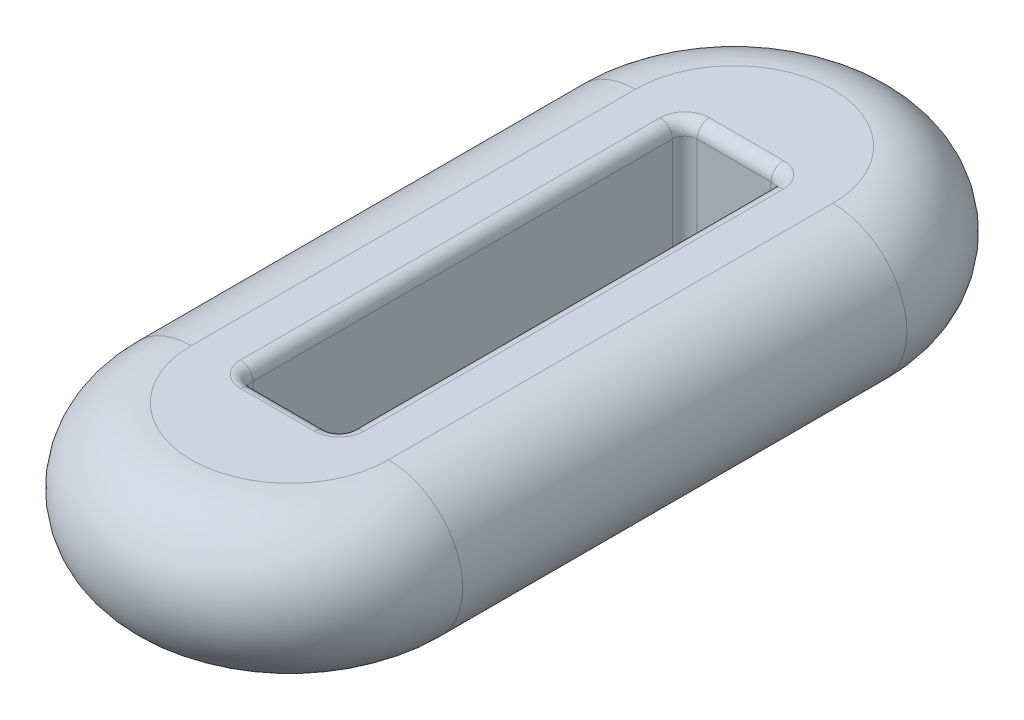
ISO-10303-21;
HEADER;
FILE_DESCRIPTION(('STEP AP214'),'2;1');
FILE_NAME('part.step','',(''),(''),'','','');
FILE_SCHEMA(('AUTOMOTIVE_DESIGN { 1 0 10303 214 1 1 1 1 }'));
ENDSEC;
DATA;
#1=APPLICATION_CONTEXT('core data for automotive mechanical design processes');
#2=APPLICATION_PROTOCOL_DEFINITION('international standard','automotive_design',2000,#1);
#3=PRODUCT_CONTEXT('',#1,'mechanical');
#4=PRODUCT('Part','Part','',(#3));
#5=PRODUCT_RELATED_PRODUCT_CATEGORY('part','',(#4));
#6=PRODUCT_DEFINITION_FORMATION('','',#4);
#7=PRODUCT_DEFINITION_CONTEXT('part definition',#1,'design');
#8=PRODUCT_DEFINITION('design','',#6,#7);
#9=PRODUCT_DEFINITION_SHAPE('','',#8);
#10=(LENGTH_UNIT() NAMED_UNIT(*) SI_UNIT(.MILLI.,.METRE.));
#11=(NAMED_UNIT(*) PLANE_ANGLE_UNIT() SI_UNIT($,.RADIAN.));
#12=(NAMED_UNIT(*) SI_UNIT($,.STERADIAN.) SOLID_ANGLE_UNIT());
#13=UNCERTAINTY_MEASURE_WITH_UNIT(LENGTH_MEASURE(1.E-05),#10,'distance_accuracy_value','');
#14=(GEOMETRIC_REPRESENTATION_CONTEXT(3) GLOBAL_UNCERTAINTY_ASSIGNED_CONTEXT((#13)) GLOBAL_UNIT_ASSIGNED_CONTEXT((#10,
#11,#12)) REPRESENTATION_CONTEXT('',''));
#15=CARTESIAN_POINT('',(0.,0.,0.));
#16=DIRECTION('',(0.,0.,1.));
#17=DIRECTION('',(1.,0.,0.));
#18=AXIS2_PLACEMENT_3D('',#15,#16,#17);
#19=CARTESIAN_POINT('',(0.,0.,4.5));
#20=DIRECTION('',(0.,-1.,0.));
#21=DIRECTION('',(0.,0.,-1.));
#22=AXIS2_PLACEMENT_3D('',#19,#20,#21);
#23=TOROIDAL_SURFACE('',#22,2.,1.5);
#24=CARTESIAN_POINT('',(-2.,0.,4.5));
#25=DIRECTION('',(0.,0.,-1.));
#26=DIRECTION('',(-1.,0.,0.));
#27=AXIS2_PLACEMENT_3D('',#24,#25,#26);
#28=CIRCLE('',#27,1.5);
#29=CARTESIAN_POINT('',(-2.,-1.5,4.5));
#30=VERTEX_POINT('',#29);
#31=CARTESIAN_POINT('',(-2.,1.5,4.5));
#32=VERTEX_POINT('',#31);
#33=EDGE_CURVE('E11',#30,#32,#28,.T.);
#34=ORIENTED_EDGE('',*,*,#33,.F.);
#35=CARTESIAN_POINT('',(0.,-1.5,4.5));
#36=DIRECTION('',(0.,1.,0.));
#37=DIRECTION('',(0.,0.,1.));
#38=AXIS2_PLACEMENT_3D('',#35,#36,#37);
#39=CIRCLE('',#38,2.);
#40=CARTESIAN_POINT('',(2.,-1.5,4.5));
#41=VERTEX_POINT('',#40);
#42=EDGE_CURVE('E252',#41,#30,#39,.F.);
#43=ORIENTED_EDGE('',*,*,#42,.F.);
#44=CARTESIAN_POINT('',(2.,0.,4.5));
#45=DIRECTION('',(0.,0.,1.));
#46=DIRECTION('',(1.,0.,0.));
#47=AXIS2_PLACEMENT_3D('',#44,#45,#46);
#48=CIRCLE('',#47,1.5);
#49=CARTESIAN_POINT('',(2.,1.5,4.5));
#50=VERTEX_POINT('',#49);
#51=EDGE_CURVE('E43',#41,#50,#48,.T.);
#52=ORIENTED_EDGE('',*,*,#51,.T.);
#53=CARTESIAN_POINT('',(0.,1.5,4.5));
#54=DIRECTION('',(0.,1.,0.));
#55=DIRECTION('',(0.,0.,1.));
#56=AXIS2_PLACEMENT_3D('',#53,#54,#55);
#57=CIRCLE('',#56,2.);
#58=EDGE_CURVE('E304',#32,#50,#57,.T.);
#59=ORIENTED_EDGE('',*,*,#58,.F.);
#60=EDGE_LOOP('',(#34,#43,#52,#59));
#61=FACE_BOUND('',#60,.T.);
#62=ADVANCED_FACE('F36',(#61),#23,.T.);
#63=CARTESIAN_POINT('',(2.,0.,-4.5));
#64=DIRECTION('',(0.,0.,1.));
#65=DIRECTION('',(1.,0.,0.));
#66=AXIS2_PLACEMENT_3D('',#63,#64,#65);
#67=CYLINDRICAL_SURFACE('',#66,1.5);
#68=ORIENTED_EDGE('',*,*,#51,.F.);
#69=DIRECTION('',(0.,0.,1.));
#70=VECTOR('',#69,1.);
#71=CARTESIAN_POINT('',(2.,-1.5,8.));
#72=LINE('',#71,#70);
#73=CARTESIAN_POINT('',(2.,-1.5,-4.5));
#74=VERTEX_POINT('',#73);
#75=EDGE_CURVE('E295',#74,#41,#72,.T.);
#76=ORIENTED_EDGE('',*,*,#75,.F.);
#77=CARTESIAN_POINT('',(2.,0.,-4.5));
#78=DIRECTION('',(0.,0.,1.));
#79=DIRECTION('',(1.,0.,0.));
#80=AXIS2_PLACEMENT_3D('',#77,#78,#79);
#81=CIRCLE('',#80,1.5);
#82=CARTESIAN_POINT('',(2.,1.5,-4.5));
#83=VERTEX_POINT('',#82);
#84=EDGE_CURVE('E58',#74,#83,#81,.T.);
#85=ORIENTED_EDGE('',*,*,#84,.T.);
#86=DIRECTION('',(0.,0.,-1.));
#87=VECTOR('',#86,1.);
#88=CARTESIAN_POINT('',(2.,1.5,-4.5));
#89=LINE('',#88,#87);
#90=EDGE_CURVE('E307',#50,#83,#89,.T.);
#91=ORIENTED_EDGE('',*,*,#90,.F.);
#92=EDGE_LOOP('',(#68,#76,#85,#91));
#93=FACE_BOUND('',#92,.T.);
#94=ADVANCED_FACE('F320',(#93),#67,.T.);
#95=CARTESIAN_POINT('',(0.,0.,-4.5));
#96=DIRECTION('',(0.,-1.,0.));
#97=DIRECTION('',(0.,0.,-1.));
#98=AXIS2_PLACEMENT_3D('',#95,#96,#97);
#99=TOROIDAL_SURFACE('',#98,2.,1.5);
#100=ORIENTED_EDGE('',*,*,#84,.F.);
#101=CARTESIAN_POINT('',(0.,-1.5,-4.5));
#102=DIRECTION('',(0.,1.,0.));
#103=DIRECTION('',(0.,0.,1.));
#104=AXIS2_PLACEMENT_3D('',#101,#102,#103);
#105=CIRCLE('',#104,2.);
#106=CARTESIAN_POINT('',(-2.,-1.5,-4.5));
#107=VERTEX_POINT('',#106);
#108=EDGE_CURVE('E298',#107,#74,#105,.F.);
#109=ORIENTED_EDGE('',*,*,#108,.F.);
#110=CARTESIAN_POINT('',(-2.,0.,-4.5));
#111=DIRECTION('',(0.,0.,-1.));
#112=DIRECTION('',(-1.,0.,0.));
#113=AXIS2_PLACEMENT_3D('',#110,#111,#112);
#114=CIRCLE('',#113,1.5);
#115=CARTESIAN_POINT('',(-2.,1.5,-4.5));
#116=VERTEX_POINT('',#115);
#117=EDGE_CURVE('E50',#107,#116,#114,.T.);
#118=ORIENTED_EDGE('',*,*,#117,.T.);
#119=CARTESIAN_POINT('',(0.,1.5,-4.5));
#120=DIRECTION('',(0.,1.,0.));
#121=DIRECTION('',(0.,0.,1.));
#122=AXIS2_PLACEMENT_3D('',#119,#120,#121);
#123=CIRCLE('',#122,2.);
#124=EDGE_CURVE('E310',#83,#116,#123,.T.);
#125=ORIENTED_EDGE('',*,*,#124,.F.);
#126=EDGE_LOOP('',(#100,#109,#118,#125));
#127=FACE_BOUND('',#126,.T.);
#128=ADVANCED_FACE('F328',(#127),#99,.T.);
#129=CARTESIAN_POINT('',(-2.,0.,4.5));
#130=DIRECTION('',(0.,0.,-1.));
#131=DIRECTION('',(-1.,0.,0.));
#132=AXIS2_PLACEMENT_3D('',#129,#130,#131);
#133=CYLINDRICAL_SURFACE('',#132,1.5);
#134=DIRECTION('',(0.,0.,-1.));
#135=VECTOR('',#134,1.);
#136=CARTESIAN_POINT('',(-2.,-1.5,8.));
#137=LINE('',#136,#135);
#138=EDGE_CURVE('E301',#30,#107,#137,.T.);
#139=ORIENTED_EDGE('',*,*,#138,.F.);
#140=ORIENTED_EDGE('',*,*,#33,.T.);
#141=DIRECTION('',(0.,0.,1.));
#142=VECTOR('',#141,1.);
#143=CARTESIAN_POINT('',(-2.,1.5,4.5));
#144=LINE('',#143,#142);
#145=EDGE_CURVE('E313',#116,#32,#144,.T.);
#146=ORIENTED_EDGE('',*,*,#145,.F.);
#147=ORIENTED_EDGE('',*,*,#117,.F.);
#148=EDGE_LOOP('',(#139,#140,#146,#147));
#149=FACE_BOUND('',#148,.T.);
#150=ADVANCED_FACE('F326',(#149),#133,.T.);
#151=CARTESIAN_POINT('',(-3.5,1.5,8.));
#152=DIRECTION('',(0.,1.,0.));
#153=DIRECTION('',(0.,0.,1.));
#154=AXIS2_PLACEMENT_3D('',#151,#152,#153);
#155=PLANE('',#154);
#156=ORIENTED_EDGE('',*,*,#124,.T.);
#157=ORIENTED_EDGE('',*,*,#145,.T.);
#158=ORIENTED_EDGE('',*,*,#58,.T.);
#159=ORIENTED_EDGE('',*,*,#90,.T.);
#160=EDGE_LOOP('',(#156,#157,#158,#159));
#161=FACE_BOUND('',#160,.T.);
#162=DIRECTION('',(0.,0.,1.));
#163=VECTOR('',#162,1.);
#164=CARTESIAN_POINT('',(-1.25,1.5,8.));
#165=LINE('',#164,#163);
#166=CARTESIAN_POINT('',(-1.25,1.5,4.25));
#167=VERTEX_POINT('',#166);
#168=CARTESIAN_POINT('',(-1.25,1.5,-4.25));
#169=VERTEX_POINT('',#168);
#170=EDGE_CURVE('E232',#167,#169,#165,.F.);
#171=ORIENTED_EDGE('',*,*,#170,.T.);
#172=CARTESIAN_POINT('',(-0.75,1.5,-4.25));
#173=DIRECTION('',(0.,1.,0.));
#174=DIRECTION('',(0.,0.,1.));
#175=AXIS2_PLACEMENT_3D('',#172,#173,#174);
#176=CIRCLE('',#175,0.5);
#177=CARTESIAN_POINT('',(-0.75,1.5,-4.75));
#178=VERTEX_POINT('',#177);
#179=EDGE_CURVE('E246',#169,#178,#176,.F.);
#180=ORIENTED_EDGE('',*,*,#179,.T.);
#181=DIRECTION('',(-1.,0.,0.));
#182=VECTOR('',#181,1.);
#183=CARTESIAN_POINT('',(-3.5,1.5,-4.75));
#184=LINE('',#183,#182);
#185=CARTESIAN_POINT('',(0.749999999999999,1.5,-4.75));
#186=VERTEX_POINT('',#185);
#187=EDGE_CURVE('E244',#178,#186,#184,.F.);
#188=ORIENTED_EDGE('',*,*,#187,.T.);
#189=CARTESIAN_POINT('',(0.749999999999999,1.5,-4.25));
#190=DIRECTION('',(0.,1.,0.));
#191=DIRECTION('',(0.,0.,1.));
#192=AXIS2_PLACEMENT_3D('',#189,#190,#191);
#193=CIRCLE('',#192,0.5);
#194=CARTESIAN_POINT('',(1.25,1.5,-4.25));
#195=VERTEX_POINT('',#194);
#196=EDGE_CURVE('E242',#186,#195,#193,.F.);
#197=ORIENTED_EDGE('',*,*,#196,.T.);
#198=DIRECTION('',(0.,0.,-1.));
#199=VECTOR('',#198,1.);
#200=CARTESIAN_POINT('',(1.25,1.5,8.));
#201=LINE('',#200,#199);
#202=CARTESIAN_POINT('',(1.25,1.5,4.25));
#203=VERTEX_POINT('',#202);
#204=EDGE_CURVE('E240',#195,#203,#201,.F.);
#205=ORIENTED_EDGE('',*,*,#204,.T.);
#206=CARTESIAN_POINT('',(0.749999999999999,1.5,4.25));
#207=DIRECTION('',(0.,1.,0.));
#208=DIRECTION('',(0.,0.,1.));
#209=AXIS2_PLACEMENT_3D('',#206,#207,#208);
#210=CIRCLE('',#209,0.5);
#211=CARTESIAN_POINT('',(0.75,1.5,4.75));
#212=VERTEX_POINT('',#211);
#213=EDGE_CURVE('E238',#203,#212,#210,.F.);
#214=ORIENTED_EDGE('',*,*,#213,.T.);
#215=DIRECTION('',(1.,0.,0.));
#216=VECTOR('',#215,1.);
#217=CARTESIAN_POINT('',(-3.5,1.5,4.75));
#218=LINE('',#217,#216);
#219=CARTESIAN_POINT('',(-0.75,1.5,4.75));
#220=VERTEX_POINT('',#219);
#221=EDGE_CURVE('E236',#212,#220,#218,.F.);
#222=ORIENTED_EDGE('',*,*,#221,.T.);
#223=CARTESIAN_POINT('',(-0.75,1.5,4.25));
#224=DIRECTION('',(0.,1.,0.));
#225=DIRECTION('',(0.,0.,1.));
#226=AXIS2_PLACEMENT_3D('',#223,#224,#225);
#227=CIRCLE('',#226,0.5);
#228=EDGE_CURVE('E234',#220,#167,#227,.F.);
#229=ORIENTED_EDGE('',*,*,#228,.T.);
#230=EDGE_LOOP('',(#171,#180,#188,#197,#205,#214,#222,#229));
#231=FACE_BOUND('',#230,.T.);
#232=ADVANCED_FACE('F322',(#161,#231),#155,.T.);
#233=CARTESIAN_POINT('',(-3.5,-1.5,8.));
#234=DIRECTION('',(0.,1.,0.));
#235=DIRECTION('',(0.,0.,1.));
#236=AXIS2_PLACEMENT_3D('',#233,#234,#235);
#237=PLANE('',#236);
#238=ORIENTED_EDGE('',*,*,#42,.T.);
#239=ORIENTED_EDGE('',*,*,#138,.T.);
#240=ORIENTED_EDGE('',*,*,#108,.T.);
#241=ORIENTED_EDGE('',*,*,#75,.T.);
#242=EDGE_LOOP('',(#238,#239,#240,#241));
#243=FACE_BOUND('',#242,.T.);
#244=DIRECTION('',(-1.,0.,0.));
#245=VECTOR('',#244,1.);
#246=CARTESIAN_POINT('',(-0.75,-1.5,-4.75));
#247=LINE('',#246,#245);
#248=CARTESIAN_POINT('',(0.749999999999999,-1.5,-4.75));
#249=VERTEX_POINT('',#248);
#250=CARTESIAN_POINT('',(-0.75,-1.5,-4.75));
#251=VERTEX_POINT('',#250);
#252=EDGE_CURVE('E197',#249,#251,#247,.T.);
#253=ORIENTED_EDGE('',*,*,#252,.T.);
#254=CARTESIAN_POINT('',(-0.75,-1.5,-4.25));
#255=DIRECTION('',(0.,1.,0.));
#256=DIRECTION('',(0.,0.,1.));
#257=AXIS2_PLACEMENT_3D('',#254,#255,#256);
#258=CIRCLE('',#257,0.5);
#259=CARTESIAN_POINT('',(-1.25,-1.5,-4.25));
#260=VERTEX_POINT('',#259);
#261=EDGE_CURVE('E177',#251,#260,#258,.T.);
#262=ORIENTED_EDGE('',*,*,#261,.T.);
#263=DIRECTION('',(0.,0.,1.));
#264=VECTOR('',#263,1.);
#265=CARTESIAN_POINT('',(-1.25,-1.5,4.25));
#266=LINE('',#265,#264);
#267=CARTESIAN_POINT('',(-1.25,-1.5,4.25));
#268=VERTEX_POINT('',#267);
#269=EDGE_CURVE('E186',#260,#268,#266,.T.);
#270=ORIENTED_EDGE('',*,*,#269,.T.);
#271=CARTESIAN_POINT('',(-0.75,-1.5,4.25));
#272=DIRECTION('',(0.,1.,0.));
#273=DIRECTION('',(0.,0.,1.));
#274=AXIS2_PLACEMENT_3D('',#271,#272,#273);
#275=CIRCLE('',#274,0.5);
#276=CARTESIAN_POINT('',(-0.75,-1.5,4.75));
#277=VERTEX_POINT('',#276);
#278=EDGE_CURVE('E192',#268,#277,#275,.T.);
#279=ORIENTED_EDGE('',*,*,#278,.T.);
#280=DIRECTION('',(1.,0.,0.));
#281=VECTOR('',#280,1.);
#282=CARTESIAN_POINT('',(0.75,-1.5,4.75));
#283=LINE('',#282,#281);
#284=CARTESIAN_POINT('',(0.75,-1.5,4.75));
#285=VERTEX_POINT('',#284);
#286=EDGE_CURVE('E652',#277,#285,#283,.T.);
#287=ORIENTED_EDGE('',*,*,#286,.T.);
#288=CARTESIAN_POINT('',(0.749999999999999,-1.5,4.25));
#289=DIRECTION('',(0.,1.,0.));
#290=DIRECTION('',(0.,0.,1.));
#291=AXIS2_PLACEMENT_3D('',#288,#289,#290);
#292=CIRCLE('',#291,0.5);
#293=CARTESIAN_POINT('',(1.25,-1.5,4.25));
#294=VERTEX_POINT('',#293);
#295=EDGE_CURVE('E654',#285,#294,#292,.T.);
#296=ORIENTED_EDGE('',*,*,#295,.T.);
#297=DIRECTION('',(0.,0.,-1.));
#298=VECTOR('',#297,1.);
#299=CARTESIAN_POINT('',(1.25,-1.5,-4.25));
#300=LINE('',#299,#298);
#301=CARTESIAN_POINT('',(1.25,-1.5,-4.25));
#302=VERTEX_POINT('',#301);
#303=EDGE_CURVE('E656',#294,#302,#300,.T.);
#304=ORIENTED_EDGE('',*,*,#303,.T.);
#305=CARTESIAN_POINT('',(0.749999999999999,-1.5,-4.25));
#306=DIRECTION('',(0.,1.,0.));
#307=DIRECTION('',(0.,0.,1.));
#308=AXIS2_PLACEMENT_3D('',#305,#306,#307);
#309=CIRCLE('',#308,0.5);
#310=EDGE_CURVE('E203',#302,#249,#309,.T.);
#311=ORIENTED_EDGE('',*,*,#310,.T.);
#312=EDGE_LOOP('',(#253,#262,#270,#279,#287,#296,#304,#311));
#313=FACE_BOUND('',#312,.T.);
#314=ADVANCED_FACE('F195',(#243,#313),#237,.F.);
#315=CARTESIAN_POINT('',(-1.,1.5,-4.5));
#316=DIRECTION('',(1.,0.,0.));
#317=DIRECTION('',(0.,0.,-1.));
#318=AXIS2_PLACEMENT_3D('',#315,#316,#317);
#319=PLANE('',#318);
#320=DIRECTION('',(0.,-1.,0.));
#321=VECTOR('',#320,1.);
#322=CARTESIAN_POINT('',(-1.,-1.5,4.25));
#323=LINE('',#322,#321);
#324=CARTESIAN_POINT('',(-1.,1.25,4.25));
#325=VERTEX_POINT('',#324);
#326=CARTESIAN_POINT('',(-1.,-1.25,4.25));
#327=VERTEX_POINT('',#326);
#328=EDGE_CURVE('E641',#325,#327,#323,.T.);
#329=ORIENTED_EDGE('',*,*,#328,.T.);
#330=DIRECTION('',(0.,0.,1.));
#331=VECTOR('',#330,1.);
#332=CARTESIAN_POINT('',(-1.,-1.25,-4.25));
#333=LINE('',#332,#331);
#334=CARTESIAN_POINT('',(-1.,-1.25,-4.25));
#335=VERTEX_POINT('',#334);
#336=EDGE_CURVE('E251',#327,#335,#333,.F.);
#337=ORIENTED_EDGE('',*,*,#336,.T.);
#338=DIRECTION('',(0.,-1.,0.));
#339=VECTOR('',#338,1.);
#340=CARTESIAN_POINT('',(-1.,1.5,-4.25));
#341=LINE('',#340,#339);
#342=CARTESIAN_POINT('',(-1.,1.25,-4.25));
#343=VERTEX_POINT('',#342);
#344=EDGE_CURVE('E637',#335,#343,#341,.F.);
#345=ORIENTED_EDGE('',*,*,#344,.T.);
#346=DIRECTION('',(0.,0.,1.));
#347=VECTOR('',#346,1.);
#348=CARTESIAN_POINT('',(-1.,1.25,-4.5));
#349=LINE('',#348,#347);
#350=EDGE_CURVE('E249',#343,#325,#349,.T.);
#351=ORIENTED_EDGE('',*,*,#350,.T.);
#352=EDGE_LOOP('',(#329,#337,#345,#351));
#353=FACE_BOUND('',#352,.T.);
#354=ADVANCED_FACE('F371',(#353),#319,.T.);
#355=CARTESIAN_POINT('',(-1.,1.5,4.5));
#356=DIRECTION('',(0.,0.,-1.));
#357=DIRECTION('',(-1.,0.,0.));
#358=AXIS2_PLACEMENT_3D('',#355,#356,#357);
#359=PLANE('',#358);
#360=DIRECTION('',(0.,-1.,0.));
#361=VECTOR('',#360,1.);
#362=CARTESIAN_POINT('',(0.749999999999999,-1.5,4.5));
#363=LINE('',#362,#361);
#364=CARTESIAN_POINT('',(0.749999999999999,1.25,4.5));
#365=VERTEX_POINT('',#364);
#366=CARTESIAN_POINT('',(0.749999999999999,-1.25,4.5));
#367=VERTEX_POINT('',#366);
#368=EDGE_CURVE('E193',#365,#367,#363,.T.);
#369=ORIENTED_EDGE('',*,*,#368,.T.);
#370=DIRECTION('',(1.,0.,0.));
#371=VECTOR('',#370,1.);
#372=CARTESIAN_POINT('',(-0.75,-1.25,4.5));
#373=LINE('',#372,#371);
#374=CARTESIAN_POINT('',(-0.75,-1.25,4.5));
#375=VERTEX_POINT('',#374);
#376=EDGE_CURVE('E226',#367,#375,#373,.F.);
#377=ORIENTED_EDGE('',*,*,#376,.T.);
#378=DIRECTION('',(0.,-1.,0.));
#379=VECTOR('',#378,1.);
#380=CARTESIAN_POINT('',(-0.75,1.5,4.5));
#381=LINE('',#380,#379);
#382=CARTESIAN_POINT('',(-0.75,1.25,4.5));
#383=VERTEX_POINT('',#382);
#384=EDGE_CURVE('E640',#375,#383,#381,.F.);
#385=ORIENTED_EDGE('',*,*,#384,.T.);
#386=DIRECTION('',(1.,0.,0.));
#387=VECTOR('',#386,1.);
#388=CARTESIAN_POINT('',(-1.,1.25,4.5));
#389=LINE('',#388,#387);
#390=EDGE_CURVE('E224',#383,#365,#389,.T.);
#391=ORIENTED_EDGE('',*,*,#390,.T.);
#392=EDGE_LOOP('',(#369,#377,#385,#391));
#393=FACE_BOUND('',#392,.T.);
#394=ADVANCED_FACE('F381',(#393),#359,.T.);
#395=CARTESIAN_POINT('',(0.999999999999999,1.5,-4.5));
#396=DIRECTION('',(-1.,0.,0.));
#397=DIRECTION('',(0.,0.,1.));
#398=AXIS2_PLACEMENT_3D('',#395,#396,#397);
#399=PLANE('',#398);
#400=DIRECTION('',(0.,-1.,0.));
#401=VECTOR('',#400,1.);
#402=CARTESIAN_POINT('',(0.999999999999999,-1.5,-4.25));
#403=LINE('',#402,#401);
#404=CARTESIAN_POINT('',(0.999999999999999,1.25,-4.25));
#405=VERTEX_POINT('',#404);
#406=CARTESIAN_POINT('',(0.999999999999999,-1.25,-4.25));
#407=VERTEX_POINT('',#406);
#408=EDGE_CURVE('E666',#405,#407,#403,.T.);
#409=ORIENTED_EDGE('',*,*,#408,.T.);
#410=DIRECTION('',(0.,0.,-1.));
#411=VECTOR('',#410,1.);
#412=CARTESIAN_POINT('',(0.999999999999999,-1.25,4.25));
#413=LINE('',#412,#411);
#414=CARTESIAN_POINT('',(0.999999999999999,-1.25,4.25));
#415=VERTEX_POINT('',#414);
#416=EDGE_CURVE('E218',#407,#415,#413,.F.);
#417=ORIENTED_EDGE('',*,*,#416,.T.);
#418=DIRECTION('',(0.,-1.,0.));
#419=VECTOR('',#418,1.);
#420=CARTESIAN_POINT('',(0.999999999999999,1.5,4.25));
#421=LINE('',#420,#419);
#422=CARTESIAN_POINT('',(0.999999999999999,1.25,4.25));
#423=VERTEX_POINT('',#422);
#424=EDGE_CURVE('E271',#415,#423,#421,.F.);
#425=ORIENTED_EDGE('',*,*,#424,.T.);
#426=DIRECTION('',(0.,0.,-1.));
#427=VECTOR('',#426,1.);
#428=CARTESIAN_POINT('',(0.999999999999999,1.25,-4.5));
#429=LINE('',#428,#427);
#430=EDGE_CURVE('E216',#423,#405,#429,.T.);
#431=ORIENTED_EDGE('',*,*,#430,.T.);
#432=EDGE_LOOP('',(#409,#417,#425,#431));
#433=FACE_BOUND('',#432,.T.);
#434=ADVANCED_FACE('F388',(#433),#399,.T.);
#435=CARTESIAN_POINT('',(-1.,1.5,-4.5));
#436=DIRECTION('',(0.,0.,1.));
#437=DIRECTION('',(1.,0.,0.));
#438=AXIS2_PLACEMENT_3D('',#435,#436,#437);
#439=PLANE('',#438);
#440=DIRECTION('',(0.,-1.,0.));
#441=VECTOR('',#440,1.);
#442=CARTESIAN_POINT('',(-0.75,-1.5,-4.5));
#443=LINE('',#442,#441);
#444=CARTESIAN_POINT('',(-0.75,1.25,-4.5));
#445=VERTEX_POINT('',#444);
#446=CARTESIAN_POINT('',(-0.75,-1.25,-4.5));
#447=VERTEX_POINT('',#446);
#448=EDGE_CURVE('E639',#445,#447,#443,.T.);
#449=ORIENTED_EDGE('',*,*,#448,.T.);
#450=DIRECTION('',(-1.,0.,0.));
#451=VECTOR('',#450,1.);
#452=CARTESIAN_POINT('',(0.749999999999999,-1.25,-4.5));
#453=LINE('',#452,#451);
#454=CARTESIAN_POINT('',(0.749999999999999,-1.25,-4.5));
#455=VERTEX_POINT('',#454);
#456=EDGE_CURVE('E210',#447,#455,#453,.F.);
#457=ORIENTED_EDGE('',*,*,#456,.T.);
#458=DIRECTION('',(0.,-1.,0.));
#459=VECTOR('',#458,1.);
#460=CARTESIAN_POINT('',(0.749999999999999,1.5,-4.5));
#461=LINE('',#460,#459);
#462=CARTESIAN_POINT('',(0.749999999999999,1.25,-4.5));
#463=VERTEX_POINT('',#462);
#464=EDGE_CURVE('E645',#455,#463,#461,.F.);
#465=ORIENTED_EDGE('',*,*,#464,.T.);
#466=DIRECTION('',(-1.,0.,0.));
#467=VECTOR('',#466,1.);
#468=CARTESIAN_POINT('',(-1.,1.25,-4.5));
#469=LINE('',#468,#467);
#470=EDGE_CURVE('E208',#463,#445,#469,.T.);
#471=ORIENTED_EDGE('',*,*,#470,.T.);
#472=EDGE_LOOP('',(#449,#457,#465,#471));
#473=FACE_BOUND('',#472,.T.);
#474=ADVANCED_FACE('F396',(#473),#439,.T.);
#475=CARTESIAN_POINT('',(0.749999999999999,1.5,-4.25));
#476=DIRECTION('',(0.,1.,0.));
#477=DIRECTION('',(0.,0.,1.));
#478=AXIS2_PLACEMENT_3D('',#475,#476,#477);
#479=CYLINDRICAL_SURFACE('',#478,0.25);
#480=ORIENTED_EDGE('',*,*,#464,.F.);
#481=CARTESIAN_POINT('',(0.749999999999999,-1.25,-4.25));
#482=DIRECTION('',(0.,1.,0.));
#483=DIRECTION('',(0.,0.,1.));
#484=AXIS2_PLACEMENT_3D('',#481,#482,#483);
#485=CIRCLE('',#484,0.25);
#486=EDGE_CURVE('E214',#455,#407,#485,.F.);
#487=ORIENTED_EDGE('',*,*,#486,.T.);
#488=ORIENTED_EDGE('',*,*,#408,.F.);
#489=CARTESIAN_POINT('',(0.749999999999999,1.25,-4.25));
#490=DIRECTION('',(0.,1.,0.));
#491=DIRECTION('',(0.,0.,1.));
#492=AXIS2_PLACEMENT_3D('',#489,#490,#491);
#493=CIRCLE('',#492,0.25);
#494=EDGE_CURVE('E212',#405,#463,#493,.T.);
#495=ORIENTED_EDGE('',*,*,#494,.T.);
#496=EDGE_LOOP('',(#480,#487,#488,#495));
#497=FACE_BOUND('',#496,.T.);
#498=ADVANCED_FACE('F404',(#497),#479,.F.);
#499=CARTESIAN_POINT('',(-0.75,1.5,-4.25));
#500=DIRECTION('',(0.,1.,0.));
#501=DIRECTION('',(0.,0.,1.));
#502=AXIS2_PLACEMENT_3D('',#499,#500,#501);
#503=CYLINDRICAL_SURFACE('',#502,0.25);
#504=ORIENTED_EDGE('',*,*,#344,.F.);
#505=CARTESIAN_POINT('',(-0.75,-1.25,-4.25));
#506=DIRECTION('',(0.,1.,0.));
#507=DIRECTION('',(0.,0.,1.));
#508=AXIS2_PLACEMENT_3D('',#505,#506,#507);
#509=CIRCLE('',#508,0.25);
#510=EDGE_CURVE('E179',#335,#447,#509,.F.);
#511=ORIENTED_EDGE('',*,*,#510,.T.);
#512=ORIENTED_EDGE('',*,*,#448,.F.);
#513=CARTESIAN_POINT('',(-0.75,1.25,-4.25));
#514=DIRECTION('',(0.,1.,0.));
#515=DIRECTION('',(0.,0.,1.));
#516=AXIS2_PLACEMENT_3D('',#513,#514,#515);
#517=CIRCLE('',#516,0.25);
#518=EDGE_CURVE('E199',#445,#343,#517,.T.);
#519=ORIENTED_EDGE('',*,*,#518,.T.);
#520=EDGE_LOOP('',(#504,#511,#512,#519));
#521=FACE_BOUND('',#520,.T.);
#522=ADVANCED_FACE('F412',(#521),#503,.F.);
#523=CARTESIAN_POINT('',(0.749999999999999,1.5,4.25));
#524=DIRECTION('',(0.,1.,0.));
#525=DIRECTION('',(0.,0.,1.));
#526=AXIS2_PLACEMENT_3D('',#523,#524,#525);
#527=CYLINDRICAL_SURFACE('',#526,0.25);
#528=ORIENTED_EDGE('',*,*,#424,.F.);
#529=CARTESIAN_POINT('',(0.749999999999999,-1.25,4.25));
#530=DIRECTION('',(0.,1.,0.));
#531=DIRECTION('',(0.,0.,1.));
#532=AXIS2_PLACEMENT_3D('',#529,#530,#531);
#533=CIRCLE('',#532,0.25);
#534=EDGE_CURVE('E222',#415,#367,#533,.F.);
#535=ORIENTED_EDGE('',*,*,#534,.T.);
#536=ORIENTED_EDGE('',*,*,#368,.F.);
#537=CARTESIAN_POINT('',(0.749999999999999,1.25,4.25));
#538=DIRECTION('',(0.,1.,0.));
#539=DIRECTION('',(0.,0.,1.));
#540=AXIS2_PLACEMENT_3D('',#537,#538,#539);
#541=CIRCLE('',#540,0.25);
#542=EDGE_CURVE('E220',#365,#423,#541,.T.);
#543=ORIENTED_EDGE('',*,*,#542,.T.);
#544=EDGE_LOOP('',(#528,#535,#536,#543));
#545=FACE_BOUND('',#544,.T.);
#546=ADVANCED_FACE('F420',(#545),#527,.F.);
#547=CARTESIAN_POINT('',(-0.75,1.5,4.25));
#548=DIRECTION('',(0.,1.,0.));
#549=DIRECTION('',(0.,0.,1.));
#550=AXIS2_PLACEMENT_3D('',#547,#548,#549);
#551=CYLINDRICAL_SURFACE('',#550,0.25);
#552=ORIENTED_EDGE('',*,*,#384,.F.);
#553=CARTESIAN_POINT('',(-0.75,-1.25,4.25));
#554=DIRECTION('',(0.,1.,0.));
#555=DIRECTION('',(0.,0.,1.));
#556=AXIS2_PLACEMENT_3D('',#553,#554,#555);
#557=CIRCLE('',#556,0.25);
#558=EDGE_CURVE('E230',#375,#327,#557,.F.);
#559=ORIENTED_EDGE('',*,*,#558,.T.);
#560=ORIENTED_EDGE('',*,*,#328,.F.);
#561=CARTESIAN_POINT('',(-0.75,1.25,4.25));
#562=DIRECTION('',(0.,1.,0.));
#563=DIRECTION('',(0.,0.,1.));
#564=AXIS2_PLACEMENT_3D('',#561,#562,#563);
#565=CIRCLE('',#564,0.25);
#566=EDGE_CURVE('E228',#325,#383,#565,.T.);
#567=ORIENTED_EDGE('',*,*,#566,.T.);
#568=EDGE_LOOP('',(#552,#559,#560,#567));
#569=FACE_BOUND('',#568,.T.);
#570=ADVANCED_FACE('F428',(#569),#551,.F.);
#571=CARTESIAN_POINT('',(0.749999999999999,-1.25,4.25));
#572=DIRECTION('',(0.,1.,0.));
#573=DIRECTION('',(0.,0.,1.));
#574=AXIS2_PLACEMENT_3D('',#571,#572,#573);
#575=TOROIDAL_SURFACE('',#574,0.5,0.25);
#576=CARTESIAN_POINT('',(0.75,-1.25,4.75));
#577=DIRECTION('',(-1.,0.,0.));
#578=DIRECTION('',(0.,0.,1.));
#579=AXIS2_PLACEMENT_3D('',#576,#577,#578);
#580=CIRCLE('',#579,0.25);
#581=EDGE_CURVE('E265',#367,#285,#580,.T.);
#582=ORIENTED_EDGE('',*,*,#581,.F.);
#583=ORIENTED_EDGE('',*,*,#534,.F.);
#584=CARTESIAN_POINT('',(1.25,-1.25,4.25));
#585=DIRECTION('',(0.,0.,-1.));
#586=DIRECTION('',(-1.,0.,0.));
#587=AXIS2_PLACEMENT_3D('',#584,#585,#586);
#588=CIRCLE('',#587,0.25);
#589=EDGE_CURVE('E268',#294,#415,#588,.T.);
#590=ORIENTED_EDGE('',*,*,#589,.F.);
#591=ORIENTED_EDGE('',*,*,#295,.F.);
#592=EDGE_LOOP('',(#582,#583,#590,#591));
#593=FACE_BOUND('',#592,.T.);
#594=ADVANCED_FACE('F436',(#593),#575,.T.);
#595=CARTESIAN_POINT('',(1.25,-1.25,8.));
#596=DIRECTION('',(0.,0.,1.));
#597=DIRECTION('',(1.,0.,0.));
#598=AXIS2_PLACEMENT_3D('',#595,#596,#597);
#599=CYLINDRICAL_SURFACE('',#598,0.25);
#600=ORIENTED_EDGE('',*,*,#589,.T.);
#601=ORIENTED_EDGE('',*,*,#416,.F.);
#602=CARTESIAN_POINT('',(1.25,-1.25,-4.25));
#603=DIRECTION('',(0.,0.,-1.));
#604=DIRECTION('',(-1.,0.,0.));
#605=AXIS2_PLACEMENT_3D('',#602,#603,#604);
#606=CIRCLE('',#605,0.25);
#607=EDGE_CURVE('E262',#302,#407,#606,.T.);
#608=ORIENTED_EDGE('',*,*,#607,.F.);
#609=ORIENTED_EDGE('',*,*,#303,.F.);
#610=EDGE_LOOP('',(#600,#601,#608,#609));
#611=FACE_BOUND('',#610,.T.);
#612=ADVANCED_FACE('F444',(#611),#599,.T.);
#613=CARTESIAN_POINT('',(-3.5,-1.25,4.75));
#614=DIRECTION('',(-1.,0.,0.));
#615=DIRECTION('',(0.,0.,1.));
#616=AXIS2_PLACEMENT_3D('',#613,#614,#615);
#617=CYLINDRICAL_SURFACE('',#616,0.25);
#618=ORIENTED_EDGE('',*,*,#581,.T.);
#619=ORIENTED_EDGE('',*,*,#286,.F.);
#620=CARTESIAN_POINT('',(-0.75,-1.25,4.75));
#621=DIRECTION('',(-1.,0.,0.));
#622=DIRECTION('',(0.,0.,1.));
#623=AXIS2_PLACEMENT_3D('',#620,#621,#622);
#624=CIRCLE('',#623,0.25);
#625=EDGE_CURVE('E259',#375,#277,#624,.T.);
#626=ORIENTED_EDGE('',*,*,#625,.F.);
#627=ORIENTED_EDGE('',*,*,#376,.F.);
#628=EDGE_LOOP('',(#618,#619,#626,#627));
#629=FACE_BOUND('',#628,.T.);
#630=ADVANCED_FACE('F452',(#629),#617,.T.);
#631=CARTESIAN_POINT('',(0.749999999999999,-1.25,-4.25));
#632=DIRECTION('',(0.,1.,0.));
#633=DIRECTION('',(0.,0.,1.));
#634=AXIS2_PLACEMENT_3D('',#631,#632,#633);
#635=TOROIDAL_SURFACE('',#634,0.5,0.25);
#636=ORIENTED_EDGE('',*,*,#607,.T.);
#637=ORIENTED_EDGE('',*,*,#486,.F.);
#638=CARTESIAN_POINT('',(0.749999999999999,-1.25,-4.75));
#639=DIRECTION('',(-1.,0.,0.));
#640=DIRECTION('',(0.,0.,1.));
#641=AXIS2_PLACEMENT_3D('',#638,#639,#640);
#642=CIRCLE('',#641,0.25);
#643=EDGE_CURVE('E256',#249,#455,#642,.T.);
#644=ORIENTED_EDGE('',*,*,#643,.F.);
#645=ORIENTED_EDGE('',*,*,#310,.F.);
#646=EDGE_LOOP('',(#636,#637,#644,#645));
#647=FACE_BOUND('',#646,.T.);
#648=ADVANCED_FACE('F460',(#647),#635,.T.);
#649=CARTESIAN_POINT('',(-0.75,-1.25,4.25));
#650=DIRECTION('',(0.,1.,0.));
#651=DIRECTION('',(0.,0.,1.));
#652=AXIS2_PLACEMENT_3D('',#649,#650,#651);
#653=TOROIDAL_SURFACE('',#652,0.5,0.25);
#654=ORIENTED_EDGE('',*,*,#625,.T.);
#655=ORIENTED_EDGE('',*,*,#278,.F.);
#656=CARTESIAN_POINT('',(-1.25,-1.25,4.25));
#657=DIRECTION('',(0.,0.,-1.));
#658=DIRECTION('',(-1.,0.,0.));
#659=AXIS2_PLACEMENT_3D('',#656,#657,#658);
#660=CIRCLE('',#659,0.25);
#661=EDGE_CURVE('E189',#327,#268,#660,.T.);
#662=ORIENTED_EDGE('',*,*,#661,.F.);
#663=ORIENTED_EDGE('',*,*,#558,.F.);
#664=EDGE_LOOP('',(#654,#655,#662,#663));
#665=FACE_BOUND('',#664,.T.);
#666=ADVANCED_FACE('F468',(#665),#653,.T.);
#667=CARTESIAN_POINT('',(-3.5,-1.25,-4.75));
#668=DIRECTION('',(1.,0.,0.));
#669=DIRECTION('',(0.,0.,-1.));
#670=AXIS2_PLACEMENT_3D('',#667,#668,#669);
#671=CYLINDRICAL_SURFACE('',#670,0.25);
#672=ORIENTED_EDGE('',*,*,#643,.T.);
#673=ORIENTED_EDGE('',*,*,#456,.F.);
#674=CARTESIAN_POINT('',(-0.75,-1.25,-4.75));
#675=DIRECTION('',(-1.,0.,0.));
#676=DIRECTION('',(0.,0.,1.));
#677=AXIS2_PLACEMENT_3D('',#674,#675,#676);
#678=CIRCLE('',#677,0.25);
#679=EDGE_CURVE('E182',#251,#447,#678,.T.);
#680=ORIENTED_EDGE('',*,*,#679,.F.);
#681=ORIENTED_EDGE('',*,*,#252,.F.);
#682=EDGE_LOOP('',(#672,#673,#680,#681));
#683=FACE_BOUND('',#682,.T.);
#684=ADVANCED_FACE('F476',(#683),#671,.T.);
#685=CARTESIAN_POINT('',(-1.25,-1.25,8.));
#686=DIRECTION('',(0.,0.,-1.));
#687=DIRECTION('',(-1.,0.,0.));
#688=AXIS2_PLACEMENT_3D('',#685,#686,#687);
#689=CYLINDRICAL_SURFACE('',#688,0.25);
#690=ORIENTED_EDGE('',*,*,#661,.T.);
#691=ORIENTED_EDGE('',*,*,#269,.F.);
#692=CARTESIAN_POINT('',(-1.25,-1.25,-4.25));
#693=DIRECTION('',(0.,0.,-1.));
#694=DIRECTION('',(-1.,0.,0.));
#695=AXIS2_PLACEMENT_3D('',#692,#693,#694);
#696=CIRCLE('',#695,0.25);
#697=EDGE_CURVE('E173',#335,#260,#696,.T.);
#698=ORIENTED_EDGE('',*,*,#697,.F.);
#699=ORIENTED_EDGE('',*,*,#336,.F.);
#700=EDGE_LOOP('',(#690,#691,#698,#699));
#701=FACE_BOUND('',#700,.T.);
#702=ADVANCED_FACE('F187',(#701),#689,.T.);
#703=CARTESIAN_POINT('',(-0.75,-1.25,-4.25));
#704=DIRECTION('',(0.,1.,0.));
#705=DIRECTION('',(0.,0.,1.));
#706=AXIS2_PLACEMENT_3D('',#703,#704,#705);
#707=TOROIDAL_SURFACE('',#706,0.5,0.25);
#708=ORIENTED_EDGE('',*,*,#679,.T.);
#709=ORIENTED_EDGE('',*,*,#510,.F.);
#710=ORIENTED_EDGE('',*,*,#697,.T.);
#711=ORIENTED_EDGE('',*,*,#261,.F.);
#712=EDGE_LOOP('',(#708,#709,#710,#711));
#713=FACE_BOUND('',#712,.T.);
#714=ADVANCED_FACE('F175',(#713),#707,.T.);
#715=CARTESIAN_POINT('',(0.749999999999999,1.25,4.25));
#716=DIRECTION('',(0.,1.,0.));
#717=DIRECTION('',(0.,0.,1.));
#718=AXIS2_PLACEMENT_3D('',#715,#716,#717);
#719=TOROIDAL_SURFACE('',#718,0.5,0.25);
#720=CARTESIAN_POINT('',(1.25,1.25,4.25));
#721=DIRECTION('',(0.,0.,-1.));
#722=DIRECTION('',(-1.,0.,0.));
#723=AXIS2_PLACEMENT_3D('',#720,#721,#722);
#724=CIRCLE('',#723,0.25);
#725=EDGE_CURVE('E288',#423,#203,#724,.T.);
#726=ORIENTED_EDGE('',*,*,#725,.F.);
#727=ORIENTED_EDGE('',*,*,#542,.F.);
#728=CARTESIAN_POINT('',(0.75,1.25,4.75));
#729=DIRECTION('',(-1.,0.,0.));
#730=DIRECTION('',(0.,0.,1.));
#731=AXIS2_PLACEMENT_3D('',#728,#729,#730);
#732=CIRCLE('',#731,0.25);
#733=EDGE_CURVE('E183',#212,#365,#732,.T.);
#734=ORIENTED_EDGE('',*,*,#733,.F.);
#735=ORIENTED_EDGE('',*,*,#213,.F.);
#736=EDGE_LOOP('',(#726,#727,#734,#735));
#737=FACE_BOUND('',#736,.T.);
#738=ADVANCED_FACE('F497',(#737),#719,.T.);
#739=CARTESIAN_POINT('',(-1.,1.25,4.75));
#740=DIRECTION('',(1.,0.,0.));
#741=DIRECTION('',(0.,0.,-1.));
#742=AXIS2_PLACEMENT_3D('',#739,#740,#741);
#743=CYLINDRICAL_SURFACE('',#742,0.25);
#744=ORIENTED_EDGE('',*,*,#733,.T.);
#745=ORIENTED_EDGE('',*,*,#390,.F.);
#746=CARTESIAN_POINT('',(-0.75,1.25,4.75));
#747=DIRECTION('',(-1.,0.,0.));
#748=DIRECTION('',(0.,0.,1.));
#749=AXIS2_PLACEMENT_3D('',#746,#747,#748);
#750=CIRCLE('',#749,0.25);
#751=EDGE_CURVE('E285',#220,#383,#750,.T.);
#752=ORIENTED_EDGE('',*,*,#751,.F.);
#753=ORIENTED_EDGE('',*,*,#221,.F.);
#754=EDGE_LOOP('',(#744,#745,#752,#753));
#755=FACE_BOUND('',#754,.T.);
#756=ADVANCED_FACE('F504',(#755),#743,.T.);
#757=CARTESIAN_POINT('',(1.25,1.25,-4.5));
#758=DIRECTION('',(0.,0.,-1.));
#759=DIRECTION('',(-1.,0.,0.));
#760=AXIS2_PLACEMENT_3D('',#757,#758,#759);
#761=CYLINDRICAL_SURFACE('',#760,0.25);
#762=ORIENTED_EDGE('',*,*,#725,.T.);
#763=ORIENTED_EDGE('',*,*,#204,.F.);
#764=CARTESIAN_POINT('',(1.25,1.25,-4.25));
#765=DIRECTION('',(0.,0.,-1.));
#766=DIRECTION('',(-1.,0.,0.));
#767=AXIS2_PLACEMENT_3D('',#764,#765,#766);
#768=CIRCLE('',#767,0.25);
#769=EDGE_CURVE('E282',#405,#195,#768,.T.);
#770=ORIENTED_EDGE('',*,*,#769,.F.);
#771=ORIENTED_EDGE('',*,*,#430,.F.);
#772=EDGE_LOOP('',(#762,#763,#770,#771));
#773=FACE_BOUND('',#772,.T.);
#774=ADVANCED_FACE('F512',(#773),#761,.T.);
#775=CARTESIAN_POINT('',(-0.75,1.25,4.25));
#776=DIRECTION('',(0.,1.,0.));
#777=DIRECTION('',(0.,0.,1.));
#778=AXIS2_PLACEMENT_3D('',#775,#776,#777);
#779=TOROIDAL_SURFACE('',#778,0.5,0.25);
#780=ORIENTED_EDGE('',*,*,#751,.T.);
#781=ORIENTED_EDGE('',*,*,#566,.F.);
#782=CARTESIAN_POINT('',(-1.25,1.25,4.25));
#783=DIRECTION('',(0.,0.,-1.));
#784=DIRECTION('',(-1.,0.,0.));
#785=AXIS2_PLACEMENT_3D('',#782,#783,#784);
#786=CIRCLE('',#785,0.25);
#787=EDGE_CURVE('E279',#167,#325,#786,.T.);
#788=ORIENTED_EDGE('',*,*,#787,.F.);
#789=ORIENTED_EDGE('',*,*,#228,.F.);
#790=EDGE_LOOP('',(#780,#781,#788,#789));
#791=FACE_BOUND('',#790,.T.);
#792=ADVANCED_FACE('F520',(#791),#779,.T.);
#793=CARTESIAN_POINT('',(0.749999999999999,1.25,-4.25));
#794=DIRECTION('',(0.,1.,0.));
#795=DIRECTION('',(0.,0.,1.));
#796=AXIS2_PLACEMENT_3D('',#793,#794,#795);
#797=TOROIDAL_SURFACE('',#796,0.5,0.25);
#798=ORIENTED_EDGE('',*,*,#769,.T.);
#799=ORIENTED_EDGE('',*,*,#196,.F.);
#800=CARTESIAN_POINT('',(0.749999999999999,1.25,-4.75));
#801=DIRECTION('',(-1.,0.,0.));
#802=DIRECTION('',(0.,0.,1.));
#803=AXIS2_PLACEMENT_3D('',#800,#801,#802);
#804=CIRCLE('',#803,0.25);
#805=EDGE_CURVE('E276',#463,#186,#804,.T.);
#806=ORIENTED_EDGE('',*,*,#805,.F.);
#807=ORIENTED_EDGE('',*,*,#494,.F.);
#808=EDGE_LOOP('',(#798,#799,#806,#807));
#809=FACE_BOUND('',#808,.T.);
#810=ADVANCED_FACE('F528',(#809),#797,.T.);
#811=CARTESIAN_POINT('',(-1.25,1.25,-4.5));
#812=DIRECTION('',(0.,0.,1.));
#813=DIRECTION('',(1.,0.,0.));
#814=AXIS2_PLACEMENT_3D('',#811,#812,#813);
#815=CYLINDRICAL_SURFACE('',#814,0.25);
#816=ORIENTED_EDGE('',*,*,#787,.T.);
#817=ORIENTED_EDGE('',*,*,#350,.F.);
#818=CARTESIAN_POINT('',(-1.25,1.25,-4.25));
#819=DIRECTION('',(0.,0.,-1.));
#820=DIRECTION('',(-1.,0.,0.));
#821=AXIS2_PLACEMENT_3D('',#818,#819,#820);
#822=CIRCLE('',#821,0.25);
#823=EDGE_CURVE('E274',#169,#343,#822,.T.);
#824=ORIENTED_EDGE('',*,*,#823,.F.);
#825=ORIENTED_EDGE('',*,*,#170,.F.);
#826=EDGE_LOOP('',(#816,#817,#824,#825));
#827=FACE_BOUND('',#826,.T.);
#828=ADVANCED_FACE('F536',(#827),#815,.T.);
#829=CARTESIAN_POINT('',(-1.,1.25,-4.75));
#830=DIRECTION('',(-1.,0.,0.));
#831=DIRECTION('',(0.,0.,1.));
#832=AXIS2_PLACEMENT_3D('',#829,#830,#831);
#833=CYLINDRICAL_SURFACE('',#832,0.25);
#834=ORIENTED_EDGE('',*,*,#805,.T.);
#835=ORIENTED_EDGE('',*,*,#187,.F.);
#836=CARTESIAN_POINT('',(-0.75,1.25,-4.75));
#837=DIRECTION('',(-1.,0.,0.));
#838=DIRECTION('',(0.,0.,1.));
#839=AXIS2_PLACEMENT_3D('',#836,#837,#838);
#840=CIRCLE('',#839,0.25);
#841=EDGE_CURVE('E272',#445,#178,#840,.T.);
#842=ORIENTED_EDGE('',*,*,#841,.F.);
#843=ORIENTED_EDGE('',*,*,#470,.F.);
#844=EDGE_LOOP('',(#834,#835,#842,#843));
#845=FACE_BOUND('',#844,.T.);
#846=ADVANCED_FACE('F544',(#845),#833,.T.);
#847=CARTESIAN_POINT('',(-0.75,1.25,-4.25));
#848=DIRECTION('',(0.,1.,0.));
#849=DIRECTION('',(0.,0.,1.));
#850=AXIS2_PLACEMENT_3D('',#847,#848,#849);
#851=TOROIDAL_SURFACE('',#850,0.5,0.25);
#852=ORIENTED_EDGE('',*,*,#823,.T.);
#853=ORIENTED_EDGE('',*,*,#518,.F.);
#854=ORIENTED_EDGE('',*,*,#841,.T.);
#855=ORIENTED_EDGE('',*,*,#179,.F.);
#856=EDGE_LOOP('',(#852,#853,#854,#855));
#857=FACE_BOUND('',#856,.T.);
#858=ADVANCED_FACE('F552',(#857),#851,.T.);
#859=CLOSED_SHELL('',(#62,#94,#128,#150,#232,#314,#354,#394,#434,#474,#498,#522,#546,#570,#594,
#612,#630,#648,#666,#684,#702,#714,#738,#756,#774,#792,#810,#828,#846,#858));
#860=MANIFOLD_SOLID_BREP('B2',#859);
#861=ADVANCED_BREP_SHAPE_REPRESENTATION('',(#18,#860),#14);
#862=SHAPE_DEFINITION_REPRESENTATION(#9,#861);
ENDSEC;
END-ISO-10303-21;
